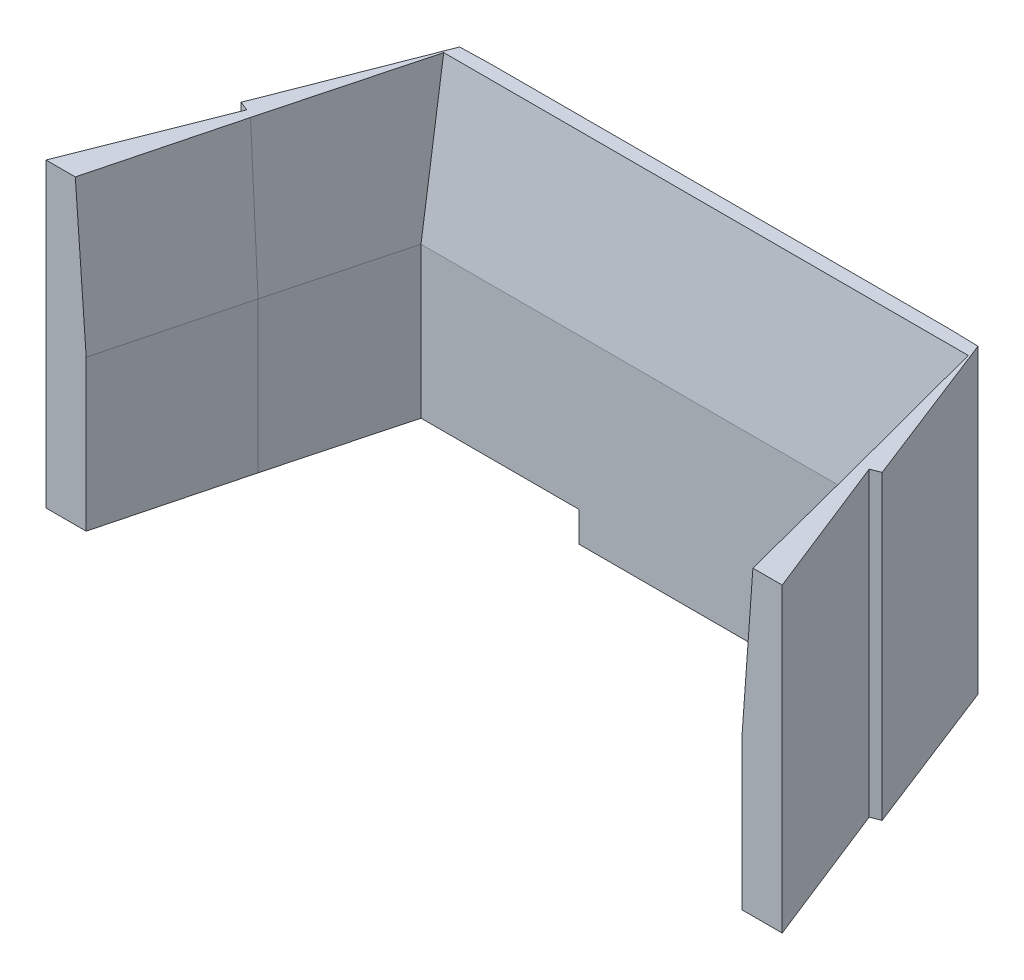
ISO-10303-21;
HEADER;
FILE_DESCRIPTION(('STEP AP214'),'2;1');
FILE_NAME('part.step','',(''),(''),'','','');
FILE_SCHEMA(('AUTOMOTIVE_DESIGN { 1 0 10303 214 1 1 1 1 }'));
ENDSEC;
DATA;
#1=APPLICATION_CONTEXT('core data for automotive mechanical design processes');
#2=APPLICATION_PROTOCOL_DEFINITION('international standard','automotive_design',2000,#1);
#3=PRODUCT_CONTEXT('',#1,'mechanical');
#4=PRODUCT('Part','Part','',(#3));
#5=PRODUCT_RELATED_PRODUCT_CATEGORY('part','',(#4));
#6=PRODUCT_DEFINITION_FORMATION('','',#4);
#7=PRODUCT_DEFINITION_CONTEXT('part definition',#1,'design');
#8=PRODUCT_DEFINITION('design','',#6,#7);
#9=PRODUCT_DEFINITION_SHAPE('','',#8);
#10=(LENGTH_UNIT() NAMED_UNIT(*) SI_UNIT(.MILLI.,.METRE.));
#11=(NAMED_UNIT(*) PLANE_ANGLE_UNIT() SI_UNIT($,.RADIAN.));
#12=(NAMED_UNIT(*) SI_UNIT($,.STERADIAN.) SOLID_ANGLE_UNIT());
#13=UNCERTAINTY_MEASURE_WITH_UNIT(LENGTH_MEASURE(1.E-05),#10,'distance_accuracy_value','');
#14=(GEOMETRIC_REPRESENTATION_CONTEXT(3) GLOBAL_UNCERTAINTY_ASSIGNED_CONTEXT((#13)) GLOBAL_UNIT_ASSIGNED_CONTEXT((#10,
#11,#12)) REPRESENTATION_CONTEXT('',''));
#15=CARTESIAN_POINT('',(0.,0.,0.));
#16=DIRECTION('',(0.,0.,1.));
#17=DIRECTION('',(1.,0.,0.));
#18=AXIS2_PLACEMENT_3D('',#15,#16,#17);
#19=CARTESIAN_POINT('',(0.,0.,0.));
#20=DIRECTION('',(0.,1.,0.));
#21=DIRECTION('',(0.,0.,1.));
#22=AXIS2_PLACEMENT_3D('',#19,#20,#21);
#23=PLANE('',#22);
#24=DIRECTION('',(1.,0.,0.));
#25=VECTOR('',#24,1.);
#26=CARTESIAN_POINT('',(0.,0.,-31.4085762737027));
#27=LINE('',#26,#25);
#28=CARTESIAN_POINT('',(1.87131752225652,0.,-31.4085762737027));
#29=VERTEX_POINT('',#28);
#30=CARTESIAN_POINT('',(17.593050571942,0.,-31.4085762737027));
#31=VERTEX_POINT('',#30);
#32=EDGE_CURVE('E219',#29,#31,#27,.T.);
#33=ORIENTED_EDGE('',*,*,#32,.F.);
#34=DIRECTION('',(0.255852608363393,0.,-0.96671580249505));
#35=VECTOR('',#34,1.);
#36=CARTESIAN_POINT('',(-6.01967544510194,0.,-1.59317729177008));
#37=LINE('',#36,#35);
#38=CARTESIAN_POINT('',(-1.52281229679167,0.,-18.5841655601201));
#39=VERTEX_POINT('',#38);
#40=EDGE_CURVE('E209',#39,#29,#37,.T.);
#41=ORIENTED_EDGE('',*,*,#40,.F.);
#42=DIRECTION('',(0.251195811000128,0.,-0.967936291568814));
#43=VECTOR('',#42,1.);
#44=CARTESIAN_POINT('',(-5.94530651938421,0.,-1.54290742664533));
#45=LINE('',#44,#43);
#46=CARTESIAN_POINT('',(-5.04813262454156,0.,-5.));
#47=VERTEX_POINT('',#46);
#48=EDGE_CURVE('E228',#47,#39,#45,.T.);
#49=ORIENTED_EDGE('',*,*,#48,.F.);
#50=DIRECTION('',(-1.,0.,0.));
#51=VECTOR('',#50,1.);
#52=CARTESIAN_POINT('',(0.,0.,-5.));
#53=LINE('',#52,#51);
#54=CARTESIAN_POINT('',(-9.04813262454156,0.,-5.));
#55=VERTEX_POINT('',#54);
#56=EDGE_CURVE('E344',#47,#55,#53,.T.);
#57=ORIENTED_EDGE('',*,*,#56,.T.);
#58=DIRECTION('',(0.367895181319904,0.,-0.929867267711685));
#59=VECTOR('',#58,1.);
#60=CARTESIAN_POINT('',(-9.5339646800782,0.,-3.77204337271335));
#61=LINE('',#60,#59);
#62=CARTESIAN_POINT('',(-3.38254683221504,0.,-19.31995592276));
#63=VERTEX_POINT('',#62);
#64=EDGE_CURVE('E275',#55,#63,#61,.T.);
#65=ORIENTED_EDGE('',*,*,#64,.T.);
#66=DIRECTION('',(-0.931536735792092,0.,-0.363647232726738));
#67=VECTOR('',#66,1.);
#68=CARTESIAN_POINT('',(6.09734401900423,0.,-15.6192579876795));
#69=LINE('',#68,#67);
#70=CARTESIAN_POINT('',(-4.31578426255812,0.,-19.6842670615286));
#71=VERTEX_POINT('',#70);
#72=EDGE_CURVE('E256',#63,#71,#69,.T.);
#73=ORIENTED_EDGE('',*,*,#72,.T.);
#74=DIRECTION('',(-0.363647232726733,0.,0.931536735792094));
#75=VECTOR('',#74,1.);
#76=CARTESIAN_POINT('',(-10.4131282815623,0.,-4.06500907384906));
#77=LINE('',#76,#75);
#78=CARTESIAN_POINT('',(1.79305057194196,0.,-35.3329604904691));
#79=VERTEX_POINT('',#78);
#80=EDGE_CURVE('E311',#79,#71,#77,.T.);
#81=ORIENTED_EDGE('',*,*,#80,.F.);
#82=DIRECTION('',(-0.999682498681667,0.,0.0251972583742492));
#83=VECTOR('',#82,1.);
#84=CARTESIAN_POINT('',(-0.888872654082395,0.,-35.2653619153664));
#85=LINE('',#84,#83);
#86=CARTESIAN_POINT('',(4.79305057194196,0.,-35.4085762737027));
#87=VERTEX_POINT('',#86);
#88=EDGE_CURVE('E331',#87,#79,#85,.T.);
#89=ORIENTED_EDGE('',*,*,#88,.F.);
#90=DIRECTION('',(-1.,0.,0.));
#91=VECTOR('',#90,1.);
#92=CARTESIAN_POINT('',(0.,0.,-35.4085762737027));
#93=LINE('',#92,#91);
#94=CARTESIAN_POINT('',(50.393050571942,0.,-35.4085762737027));
#95=VERTEX_POINT('',#94);
#96=EDGE_CURVE('E329',#95,#87,#93,.T.);
#97=ORIENTED_EDGE('',*,*,#96,.F.);
#98=DIRECTION('',(0.999682498681667,0.,0.0251972583742515));
#99=VECTOR('',#98,1.);
#100=CARTESIAN_POINT('',(0.92391041066605,0.,-36.6554588667656));
#101=LINE('',#100,#99);
#102=CARTESIAN_POINT('',(53.393050571942,0.,-35.3329604904691));
#103=VERTEX_POINT('',#102);
#104=EDGE_CURVE('E326',#95,#103,#101,.T.);
#105=ORIENTED_EDGE('',*,*,#104,.T.);
#106=DIRECTION('',(0.363647232726733,0.,0.931536735792094));
#107=VECTOR('',#106,1.);
#108=CARTESIAN_POINT('',(58.3014574957734,0.,-22.7593425655358));
#109=LINE('',#108,#107);
#110=CARTESIAN_POINT('',(59.501885406442,0.,-19.6842670615286));
#111=VERTEX_POINT('',#110);
#112=EDGE_CURVE('E323',#103,#111,#109,.T.);
#113=ORIENTED_EDGE('',*,*,#112,.T.);
#114=DIRECTION('',(-0.931536735792092,0.,0.363647232726738));
#115=VECTOR('',#114,1.);
#116=CARTESIAN_POINT('',(1.20042791066875,0.,3.07507550400744));
#117=LINE('',#116,#115);
#118=CARTESIAN_POINT('',(58.568647976099,0.,-19.31995592276));
#119=VERTEX_POINT('',#118);
#120=EDGE_CURVE('E269',#111,#119,#117,.T.);
#121=ORIENTED_EDGE('',*,*,#120,.T.);
#122=DIRECTION('',(0.367895181319904,0.,0.929867267711685));
#123=VECTOR('',#122,1.);
#124=CARTESIAN_POINT('',(57.2508000735567,0.,-22.6508601873933));
#125=LINE('',#124,#123);
#126=CARTESIAN_POINT('',(64.2342337684255,0.,-5.00000000000001));
#127=VERTEX_POINT('',#126);
#128=EDGE_CURVE('E272',#119,#127,#125,.T.);
#129=ORIENTED_EDGE('',*,*,#128,.T.);
#130=CARTESIAN_POINT('',(60.2342337684255,0.,-5.));
#131=VERTEX_POINT('',#130);
#132=EDGE_CURVE('E346',#127,#131,#53,.T.);
#133=ORIENTED_EDGE('',*,*,#132,.T.);
#134=DIRECTION('',(-0.251195811000129,0.,-0.967936291568814));
#135=VECTOR('',#134,1.);
#136=CARTESIAN_POINT('',(57.6492013542393,0.,-14.9609411423317));
#137=LINE('',#136,#135);
#138=CARTESIAN_POINT('',(56.7089134406756,0.,-18.5841655601201));
#139=VERTEX_POINT('',#138);
#140=EDGE_CURVE('E225',#131,#139,#137,.T.);
#141=ORIENTED_EDGE('',*,*,#140,.T.);
#142=DIRECTION('',(-0.255852608363393,0.,-0.96671580249505));
#143=VECTOR('',#142,1.);
#144=CARTESIAN_POINT('',(57.5932636580611,0.,-15.2427287244547));
#145=LINE('',#144,#143);
#146=CARTESIAN_POINT('',(53.3147836216274,0.,-31.4085762737027));
#147=VERTEX_POINT('',#146);
#148=EDGE_CURVE('E202',#139,#147,#145,.T.);
#149=ORIENTED_EDGE('',*,*,#148,.T.);
#150=CARTESIAN_POINT('',(37.593050571942,0.,-31.4085762737027));
#151=VERTEX_POINT('',#150);
#152=EDGE_CURVE('E212',#151,#147,#27,.T.);
#153=ORIENTED_EDGE('',*,*,#152,.F.);
#154=DIRECTION('',(0.,0.,1.));
#155=VECTOR('',#154,1.);
#156=CARTESIAN_POINT('',(37.593050571942,0.,-31.4085762737027));
#157=LINE('',#156,#155);
#158=CARTESIAN_POINT('',(37.593050571942,0.,-33.4085762737027));
#159=VERTEX_POINT('',#158);
#160=EDGE_CURVE('E283',#159,#151,#157,.T.);
#161=ORIENTED_EDGE('',*,*,#160,.F.);
#162=DIRECTION('',(1.,0.,0.));
#163=VECTOR('',#162,1.);
#164=CARTESIAN_POINT('',(17.593050571942,0.,-33.4085762737027));
#165=LINE('',#164,#163);
#166=CARTESIAN_POINT('',(17.593050571942,0.,-33.4085762737027));
#167=VERTEX_POINT('',#166);
#168=EDGE_CURVE('E292',#167,#159,#165,.T.);
#169=ORIENTED_EDGE('',*,*,#168,.F.);
#170=DIRECTION('',(0.,0.,-1.));
#171=VECTOR('',#170,1.);
#172=CARTESIAN_POINT('',(17.593050571942,0.,-31.4085762737027));
#173=LINE('',#172,#171);
#174=EDGE_CURVE('E278',#31,#167,#173,.T.);
#175=ORIENTED_EDGE('',*,*,#174,.F.);
#176=EDGE_LOOP('',(#33,#41,#49,#57,#65,#73,#81,#89,#97,#105,#113,#121,#129,#133,#141,#149,#153,
#161,#169,#175));
#177=FACE_BOUND('',#176,.T.);
#178=ADVANCED_FACE('F40',(#177),#23,.F.);
#179=CARTESIAN_POINT('',(0.,30.,0.));
#180=DIRECTION('',(0.,1.,0.));
#181=DIRECTION('',(0.,0.,1.));
#182=AXIS2_PLACEMENT_3D('',#179,#180,#181);
#183=PLANE('',#182);
#184=DIRECTION('',(1.,0.,0.));
#185=VECTOR('',#184,1.);
#186=CARTESIAN_POINT('',(54.3997996898922,30.,-34.0534809843297));
#187=LINE('',#186,#185);
#188=CARTESIAN_POINT('',(1.48630632340626,30.,-34.0534809843297));
#189=VERTEX_POINT('',#188);
#190=CARTESIAN_POINT('',(53.6997948204777,30.,-34.0534809843297));
#191=VERTEX_POINT('',#190);
#192=EDGE_CURVE('E370',#189,#191,#187,.T.);
#193=ORIENTED_EDGE('',*,*,#192,.T.);
#194=DIRECTION('',(0.255852608363393,0.,0.96671580249505));
#195=VECTOR('',#194,1.);
#196=CARTESIAN_POINT('',(58.6072539699195,30.,-15.5110930829089));
#197=LINE('',#196,#195);
#198=CARTESIAN_POINT('',(57.723549717997,30.,-18.8500891968442));
#199=VERTEX_POINT('',#198);
#200=EDGE_CURVE('E56',#191,#199,#197,.T.);
#201=ORIENTED_EDGE('',*,*,#200,.T.);
#202=DIRECTION('',(0.251195811000129,0.,0.967936291568814));
#203=VECTOR('',#202,1.);
#204=CARTESIAN_POINT('',(58.6644718397468,30.,-15.2244209758838));
#205=LINE('',#204,#203);
#206=CARTESIAN_POINT('',(61.3178817195242,30.,-5.));
#207=VERTEX_POINT('',#206);
#208=EDGE_CURVE('E352',#199,#207,#205,.T.);
#209=ORIENTED_EDGE('',*,*,#208,.T.);
#210=DIRECTION('',(1.,0.,0.));
#211=VECTOR('',#210,1.);
#212=CARTESIAN_POINT('',(-90.,30.,-5.));
#213=LINE('',#212,#211);
#214=CARTESIAN_POINT('',(64.2342337684255,30.,-5.00000000000001));
#215=VERTEX_POINT('',#214);
#216=EDGE_CURVE('E305',#207,#215,#213,.T.);
#217=ORIENTED_EDGE('',*,*,#216,.T.);
#218=DIRECTION('',(0.367895181319904,0.,0.929867267711685));
#219=VECTOR('',#218,1.);
#220=CARTESIAN_POINT('',(64.2342337684255,30.,-5.00000000000001));
#221=LINE('',#220,#219);
#222=CARTESIAN_POINT('',(58.568647976099,30.,-19.31995592276));
#223=VERTEX_POINT('',#222);
#224=EDGE_CURVE('E260',#223,#215,#221,.T.);
#225=ORIENTED_EDGE('',*,*,#224,.F.);
#226=DIRECTION('',(-0.931536735792092,0.,0.363647232726738));
#227=VECTOR('',#226,1.);
#228=CARTESIAN_POINT('',(58.568647976099,30.,-19.31995592276));
#229=LINE('',#228,#227);
#230=CARTESIAN_POINT('',(59.501885406442,30.,-19.6842670615286));
#231=VERTEX_POINT('',#230);
#232=EDGE_CURVE('E239',#231,#223,#229,.T.);
#233=ORIENTED_EDGE('',*,*,#232,.F.);
#234=DIRECTION('',(0.363647232726733,0.,0.931536735792094));
#235=VECTOR('',#234,1.);
#236=CARTESIAN_POINT('',(58.3014574957734,30.,-22.7593425655358));
#237=LINE('',#236,#235);
#238=CARTESIAN_POINT('',(53.393050571942,30.,-35.3329604904691));
#239=VERTEX_POINT('',#238);
#240=EDGE_CURVE('E307',#239,#231,#237,.T.);
#241=ORIENTED_EDGE('',*,*,#240,.F.);
#242=DIRECTION('',(0.999682498681667,0.,0.0251972583742515));
#243=VECTOR('',#242,1.);
#244=CARTESIAN_POINT('',(0.92391041066605,30.,-36.6554588667656));
#245=LINE('',#244,#243);
#246=CARTESIAN_POINT('',(50.393050571942,30.,-35.4085762737027));
#247=VERTEX_POINT('',#246);
#248=EDGE_CURVE('E310',#247,#239,#245,.T.);
#249=ORIENTED_EDGE('',*,*,#248,.F.);
#250=DIRECTION('',(-1.,0.,0.));
#251=VECTOR('',#250,1.);
#252=CARTESIAN_POINT('',(0.,30.,-35.4085762737027));
#253=LINE('',#252,#251);
#254=CARTESIAN_POINT('',(4.79305057194196,30.,-35.4085762737027));
#255=VERTEX_POINT('',#254);
#256=EDGE_CURVE('E314',#247,#255,#253,.T.);
#257=ORIENTED_EDGE('',*,*,#256,.T.);
#258=DIRECTION('',(-0.999682498681667,0.,0.0251972583742492));
#259=VECTOR('',#258,1.);
#260=CARTESIAN_POINT('',(-0.888872654082395,30.,-35.2653619153664));
#261=LINE('',#260,#259);
#262=CARTESIAN_POINT('',(1.79305057194196,30.,-35.3329604904691));
#263=VERTEX_POINT('',#262);
#264=EDGE_CURVE('E316',#255,#263,#261,.T.);
#265=ORIENTED_EDGE('',*,*,#264,.T.);
#266=DIRECTION('',(-0.363647232726733,0.,0.931536735792094));
#267=VECTOR('',#266,1.);
#268=CARTESIAN_POINT('',(-10.4131282815623,30.,-4.06500907384906));
#269=LINE('',#268,#267);
#270=CARTESIAN_POINT('',(-4.3157842625581,30.,-19.6842670615286));
#271=VERTEX_POINT('',#270);
#272=EDGE_CURVE('E318',#263,#271,#269,.T.);
#273=ORIENTED_EDGE('',*,*,#272,.T.);
#274=DIRECTION('',(-0.931536735792092,0.,-0.363647232726738));
#275=VECTOR('',#274,1.);
#276=CARTESIAN_POINT('',(-3.38254683221504,30.,-19.31995592276));
#277=LINE('',#276,#275);
#278=CARTESIAN_POINT('',(-3.38254683221504,30.,-19.31995592276));
#279=VERTEX_POINT('',#278);
#280=EDGE_CURVE('E250',#279,#271,#277,.T.);
#281=ORIENTED_EDGE('',*,*,#280,.F.);
#282=DIRECTION('',(0.367895181319904,0.,-0.929867267711685));
#283=VECTOR('',#282,1.);
#284=CARTESIAN_POINT('',(-3.529704904743,30.,-18.9480090156753));
#285=LINE('',#284,#283);
#286=CARTESIAN_POINT('',(-9.04813262454156,30.,-5.));
#287=VERTEX_POINT('',#286);
#288=EDGE_CURVE('E247',#287,#279,#285,.T.);
#289=ORIENTED_EDGE('',*,*,#288,.F.);
#290=CARTESIAN_POINT('',(-6.13178057564033,30.,-5.));
#291=VERTEX_POINT('',#290);
#292=EDGE_CURVE('E220',#287,#291,#213,.T.);
#293=ORIENTED_EDGE('',*,*,#292,.T.);
#294=DIRECTION('',(0.251195811000128,0.,-0.967936291568814));
#295=VECTOR('',#294,1.);
#296=CARTESIAN_POINT('',(-2.53808278229914,30.,-18.8476453936722));
#297=LINE('',#296,#295);
#298=CARTESIAN_POINT('',(-2.53744857411366,30.,-18.8500891968419));
#299=VERTEX_POINT('',#298);
#300=EDGE_CURVE('E363',#291,#299,#297,.T.);
#301=ORIENTED_EDGE('',*,*,#300,.T.);
#302=DIRECTION('',(0.255852608363393,0.,-0.96671580249505));
#303=VECTOR('',#302,1.);
#304=CARTESIAN_POINT('',(0.857327210398154,30.,-31.676940632157));
#305=LINE('',#304,#303);
#306=EDGE_CURVE('E64',#299,#189,#305,.T.);
#307=ORIENTED_EDGE('',*,*,#306,.T.);
#308=EDGE_LOOP('',(#193,#201,#209,#217,#225,#233,#241,#249,#257,#265,#273,#281,#289,#293,#301,#307));
#309=FACE_BOUND('',#308,.T.);
#310=ADVANCED_FACE('F379',(#309),#183,.T.);
#311=CARTESIAN_POINT('',(-90.,0.,-5.));
#312=DIRECTION('',(0.,0.,-1.));
#313=DIRECTION('',(-1.,0.,0.));
#314=AXIS2_PLACEMENT_3D('',#311,#312,#313);
#315=PLANE('',#314);
#316=ORIENTED_EDGE('',*,*,#216,.F.);
#317=DIRECTION('',(0.0720554099838902,0.99740063058535,0.));
#318=VECTOR('',#317,1.);
#319=CARTESIAN_POINT('',(61.3041052629034,29.8093044432896,-5.));
#320=LINE('',#319,#318);
#321=CARTESIAN_POINT('',(60.2342337684255,14.9999999999992,-5.));
#322=VERTEX_POINT('',#321);
#323=EDGE_CURVE('E356',#207,#322,#320,.F.);
#324=ORIENTED_EDGE('',*,*,#323,.T.);
#325=DIRECTION('',(0.,-1.,0.));
#326=VECTOR('',#325,1.);
#327=CARTESIAN_POINT('',(60.2342337684255,40.,-5.));
#328=LINE('',#327,#326);
#329=EDGE_CURVE('E244',#322,#131,#328,.T.);
#330=ORIENTED_EDGE('',*,*,#329,.T.);
#331=ORIENTED_EDGE('',*,*,#132,.F.);
#332=DIRECTION('',(0.,1.,0.));
#333=VECTOR('',#332,1.);
#334=CARTESIAN_POINT('',(64.2342337684255,-10.,-5.00000000000001));
#335=LINE('',#334,#333);
#336=EDGE_CURVE('E251',#127,#215,#335,.T.);
#337=ORIENTED_EDGE('',*,*,#336,.T.);
#338=EDGE_LOOP('',(#316,#324,#330,#331,#337));
#339=FACE_BOUND('',#338,.T.);
#340=ADVANCED_FACE('F386',(#339),#315,.F.);
#341=DIRECTION('',(0.,-1.,0.));
#342=VECTOR('',#341,1.);
#343=CARTESIAN_POINT('',(-5.04813262454156,40.,-5.));
#344=LINE('',#343,#342);
#345=CARTESIAN_POINT('',(-5.04813262454156,14.9999999999993,-5.));
#346=VERTEX_POINT('',#345);
#347=EDGE_CURVE('E242',#346,#47,#344,.T.);
#348=ORIENTED_EDGE('',*,*,#347,.F.);
#349=DIRECTION('',(-0.0720554099838902,0.99740063058535,0.));
#350=VECTOR('',#349,1.);
#351=CARTESIAN_POINT('',(-5.0527907353513,15.0644781933786,-5.));
#352=LINE('',#351,#350);
#353=EDGE_CURVE('E368',#346,#291,#352,.T.);
#354=ORIENTED_EDGE('',*,*,#353,.T.);
#355=ORIENTED_EDGE('',*,*,#292,.F.);
#356=DIRECTION('',(0.,1.,0.));
#357=VECTOR('',#356,1.);
#358=CARTESIAN_POINT('',(-9.04813262454156,-10.,-5.));
#359=LINE('',#358,#357);
#360=EDGE_CURVE('E253',#55,#287,#359,.T.);
#361=ORIENTED_EDGE('',*,*,#360,.F.);
#362=ORIENTED_EDGE('',*,*,#56,.F.);
#363=EDGE_LOOP('',(#348,#354,#355,#361,#362));
#364=FACE_BOUND('',#363,.T.);
#365=ADVANCED_FACE('F436',(#364),#315,.F.);
#366=CARTESIAN_POINT('',(0.,30.,-31.4085762737027));
#367=DIRECTION('',(0.,0.,-1.));
#368=DIRECTION('',(-1.,0.,0.));
#369=AXIS2_PLACEMENT_3D('',#366,#367,#368);
#370=PLANE('',#369);
#371=DIRECTION('',(0.,-1.,0.));
#372=VECTOR('',#371,1.);
#373=CARTESIAN_POINT('',(53.3147836216274,40.,-31.4085762737027));
#374=LINE('',#373,#372);
#375=CARTESIAN_POINT('',(53.3147836216274,14.9999999999992,-31.4085762737027));
#376=VERTEX_POINT('',#375);
#377=EDGE_CURVE('E197',#376,#147,#374,.T.);
#378=ORIENTED_EDGE('',*,*,#377,.F.);
#379=DIRECTION('',(-1.,0.,0.));
#380=VECTOR('',#379,1.);
#381=CARTESIAN_POINT('',(0.786301453991694,14.9999999999996,-31.4085762737027));
#382=LINE('',#381,#380);
#383=CARTESIAN_POINT('',(1.87131752225652,14.9999999999993,-31.4085762737027));
#384=VERTEX_POINT('',#383);
#385=EDGE_CURVE('E373',#376,#384,#382,.T.);
#386=ORIENTED_EDGE('',*,*,#385,.T.);
#387=DIRECTION('',(0.,-1.,0.));
#388=VECTOR('',#387,1.);
#389=CARTESIAN_POINT('',(1.87131752225652,40.,-31.4085762737027));
#390=LINE('',#389,#388);
#391=EDGE_CURVE('E237',#384,#29,#390,.T.);
#392=ORIENTED_EDGE('',*,*,#391,.T.);
#393=ORIENTED_EDGE('',*,*,#32,.T.);
#394=DIRECTION('',(0.,1.,0.));
#395=VECTOR('',#394,1.);
#396=CARTESIAN_POINT('',(17.593050571942,-3.,-31.4085762737027));
#397=LINE('',#396,#395);
#398=CARTESIAN_POINT('',(17.593050571942,-3.,-31.4085762737027));
#399=VERTEX_POINT('',#398);
#400=EDGE_CURVE('E289',#399,#31,#397,.T.);
#401=ORIENTED_EDGE('',*,*,#400,.F.);
#402=DIRECTION('',(-1.,0.,0.));
#403=VECTOR('',#402,1.);
#404=CARTESIAN_POINT('',(17.593050571942,-3.,-31.4085762737027));
#405=LINE('',#404,#403);
#406=CARTESIAN_POINT('',(37.593050571942,-3.,-31.4085762737027));
#407=VERTEX_POINT('',#406);
#408=EDGE_CURVE('E287',#407,#399,#405,.T.);
#409=ORIENTED_EDGE('',*,*,#408,.F.);
#410=DIRECTION('',(0.,1.,0.));
#411=VECTOR('',#410,1.);
#412=CARTESIAN_POINT('',(37.593050571942,-3.,-31.4085762737027));
#413=LINE('',#412,#411);
#414=EDGE_CURVE('E216',#407,#151,#413,.T.);
#415=ORIENTED_EDGE('',*,*,#414,.T.);
#416=ORIENTED_EDGE('',*,*,#152,.T.);
#417=EDGE_LOOP('',(#378,#386,#392,#393,#401,#409,#415,#416));
#418=FACE_BOUND('',#417,.T.);
#419=ADVANCED_FACE('F213',(#418),#370,.F.);
#420=CARTESIAN_POINT('',(58.3014574957734,30.,-22.7593425655358));
#421=DIRECTION('',(0.931536735792094,0.,-0.363647232726733));
#422=DIRECTION('',(-0.363647232726733,0.,-0.931536735792094));
#423=AXIS2_PLACEMENT_3D('',#420,#421,#422);
#424=PLANE('',#423);
#425=DIRECTION('',(0.,1.,0.));
#426=VECTOR('',#425,1.);
#427=CARTESIAN_POINT('',(59.501885406442,30.,-19.6842670615286));
#428=LINE('',#427,#426);
#429=EDGE_CURVE('E350',#111,#231,#428,.T.);
#430=ORIENTED_EDGE('',*,*,#429,.F.);
#431=ORIENTED_EDGE('',*,*,#112,.F.);
#432=DIRECTION('',(0.,-1.,0.));
#433=VECTOR('',#432,1.);
#434=CARTESIAN_POINT('',(53.393050571942,30.,-35.3329604904691));
#435=LINE('',#434,#433);
#436=EDGE_CURVE('E342',#239,#103,#435,.T.);
#437=ORIENTED_EDGE('',*,*,#436,.F.);
#438=ORIENTED_EDGE('',*,*,#240,.T.);
#439=EDGE_LOOP('',(#430,#431,#437,#438));
#440=FACE_BOUND('',#439,.T.);
#441=ADVANCED_FACE('F403',(#440),#424,.T.);
#442=CARTESIAN_POINT('',(0.92391041066605,30.,-36.6554588667656));
#443=DIRECTION('',(0.0251972583742515,0.,-0.999682498681667));
#444=DIRECTION('',(-0.999682498681667,0.,-0.0251972583742515));
#445=AXIS2_PLACEMENT_3D('',#442,#443,#444);
#446=PLANE('',#445);
#447=ORIENTED_EDGE('',*,*,#104,.F.);
#448=DIRECTION('',(0.,-1.,0.));
#449=VECTOR('',#448,1.);
#450=CARTESIAN_POINT('',(50.393050571942,30.,-35.4085762737027));
#451=LINE('',#450,#449);
#452=EDGE_CURVE('E340',#247,#95,#451,.T.);
#453=ORIENTED_EDGE('',*,*,#452,.F.);
#454=ORIENTED_EDGE('',*,*,#248,.T.);
#455=ORIENTED_EDGE('',*,*,#436,.T.);
#456=EDGE_LOOP('',(#447,#453,#454,#455));
#457=FACE_BOUND('',#456,.T.);
#458=ADVANCED_FACE('F407',(#457),#446,.T.);
#459=CARTESIAN_POINT('',(0.,30.,-35.4085762737027));
#460=DIRECTION('',(0.,0.,1.));
#461=DIRECTION('',(1.,0.,0.));
#462=AXIS2_PLACEMENT_3D('',#459,#460,#461);
#463=PLANE('',#462);
#464=ORIENTED_EDGE('',*,*,#96,.T.);
#465=DIRECTION('',(0.,-1.,0.));
#466=VECTOR('',#465,1.);
#467=CARTESIAN_POINT('',(4.79305057194196,30.,-35.4085762737027));
#468=LINE('',#467,#466);
#469=EDGE_CURVE('E337',#255,#87,#468,.T.);
#470=ORIENTED_EDGE('',*,*,#469,.F.);
#471=ORIENTED_EDGE('',*,*,#256,.F.);
#472=ORIENTED_EDGE('',*,*,#452,.T.);
#473=EDGE_LOOP('',(#464,#470,#471,#472));
#474=FACE_BOUND('',#473,.T.);
#475=ADVANCED_FACE('F413',(#474),#463,.F.);
#476=CARTESIAN_POINT('',(-0.888872654082395,30.,-35.2653619153664));
#477=DIRECTION('',(0.0251972583742492,0.,0.999682498681667));
#478=DIRECTION('',(0.999682498681667,0.,-0.0251972583742492));
#479=AXIS2_PLACEMENT_3D('',#476,#477,#478);
#480=PLANE('',#479);
#481=ORIENTED_EDGE('',*,*,#88,.T.);
#482=DIRECTION('',(0.,-1.,0.));
#483=VECTOR('',#482,1.);
#484=CARTESIAN_POINT('',(1.79305057194196,30.,-35.3329604904691));
#485=LINE('',#484,#483);
#486=EDGE_CURVE('E320',#263,#79,#485,.T.);
#487=ORIENTED_EDGE('',*,*,#486,.F.);
#488=ORIENTED_EDGE('',*,*,#264,.F.);
#489=ORIENTED_EDGE('',*,*,#469,.T.);
#490=EDGE_LOOP('',(#481,#487,#488,#489));
#491=FACE_BOUND('',#490,.T.);
#492=ADVANCED_FACE('F417',(#491),#480,.F.);
#493=CARTESIAN_POINT('',(-10.4131282815623,30.,-4.06500907384906));
#494=DIRECTION('',(0.931536735792094,0.,0.363647232726733));
#495=DIRECTION('',(0.363647232726733,0.,-0.931536735792094));
#496=AXIS2_PLACEMENT_3D('',#493,#494,#495);
#497=PLANE('',#496);
#498=ORIENTED_EDGE('',*,*,#80,.T.);
#499=DIRECTION('',(0.,1.,0.));
#500=VECTOR('',#499,1.);
#501=CARTESIAN_POINT('',(-4.31578426255811,30.,-19.6842670615286));
#502=LINE('',#501,#500);
#503=EDGE_CURVE('E347',#71,#271,#502,.T.);
#504=ORIENTED_EDGE('',*,*,#503,.T.);
#505=ORIENTED_EDGE('',*,*,#272,.F.);
#506=ORIENTED_EDGE('',*,*,#486,.T.);
#507=EDGE_LOOP('',(#498,#504,#505,#506));
#508=FACE_BOUND('',#507,.T.);
#509=ADVANCED_FACE('F421',(#508),#497,.F.);
#510=CARTESIAN_POINT('',(17.593050571942,-3.,-31.4085762737027));
#511=DIRECTION('',(1.,0.,0.));
#512=DIRECTION('',(0.,0.,-1.));
#513=AXIS2_PLACEMENT_3D('',#510,#511,#512);
#514=PLANE('',#513);
#515=ORIENTED_EDGE('',*,*,#174,.T.);
#516=DIRECTION('',(0.,1.,0.));
#517=VECTOR('',#516,1.);
#518=CARTESIAN_POINT('',(17.593050571942,-3.,-33.4085762737027));
#519=LINE('',#518,#517);
#520=CARTESIAN_POINT('',(17.593050571942,-3.,-33.4085762737027));
#521=VERTEX_POINT('',#520);
#522=EDGE_CURVE('E302',#521,#167,#519,.T.);
#523=ORIENTED_EDGE('',*,*,#522,.F.);
#524=DIRECTION('',(0.,0.,-1.));
#525=VECTOR('',#524,1.);
#526=CARTESIAN_POINT('',(17.593050571942,-3.,-31.4085762737027));
#527=LINE('',#526,#525);
#528=EDGE_CURVE('E279',#399,#521,#527,.T.);
#529=ORIENTED_EDGE('',*,*,#528,.F.);
#530=ORIENTED_EDGE('',*,*,#400,.T.);
#531=EDGE_LOOP('',(#515,#523,#529,#530));
#532=FACE_BOUND('',#531,.T.);
#533=ADVANCED_FACE('F457',(#532),#514,.F.);
#534=CARTESIAN_POINT('',(17.593050571942,-3.,-33.4085762737027));
#535=DIRECTION('',(0.,0.,1.));
#536=DIRECTION('',(1.,0.,0.));
#537=AXIS2_PLACEMENT_3D('',#534,#535,#536);
#538=PLANE('',#537);
#539=ORIENTED_EDGE('',*,*,#168,.T.);
#540=DIRECTION('',(0.,1.,0.));
#541=VECTOR('',#540,1.);
#542=CARTESIAN_POINT('',(37.593050571942,-3.,-33.4085762737027));
#543=LINE('',#542,#541);
#544=CARTESIAN_POINT('',(37.593050571942,-3.,-33.4085762737027));
#545=VERTEX_POINT('',#544);
#546=EDGE_CURVE('E299',#545,#159,#543,.T.);
#547=ORIENTED_EDGE('',*,*,#546,.F.);
#548=DIRECTION('',(1.,0.,0.));
#549=VECTOR('',#548,1.);
#550=CARTESIAN_POINT('',(17.593050571942,-3.,-33.4085762737027));
#551=LINE('',#550,#549);
#552=EDGE_CURVE('E282',#521,#545,#551,.T.);
#553=ORIENTED_EDGE('',*,*,#552,.F.);
#554=ORIENTED_EDGE('',*,*,#522,.T.);
#555=EDGE_LOOP('',(#539,#547,#553,#554));
#556=FACE_BOUND('',#555,.T.);
#557=ADVANCED_FACE('F466',(#556),#538,.F.);
#558=CARTESIAN_POINT('',(37.593050571942,-3.,-31.4085762737027));
#559=DIRECTION('',(-1.,0.,0.));
#560=DIRECTION('',(0.,0.,1.));
#561=AXIS2_PLACEMENT_3D('',#558,#559,#560);
#562=PLANE('',#561);
#563=ORIENTED_EDGE('',*,*,#160,.T.);
#564=ORIENTED_EDGE('',*,*,#414,.F.);
#565=DIRECTION('',(0.,0.,1.));
#566=VECTOR('',#565,1.);
#567=CARTESIAN_POINT('',(37.593050571942,-3.,-31.4085762737027));
#568=LINE('',#567,#566);
#569=EDGE_CURVE('E285',#545,#407,#568,.T.);
#570=ORIENTED_EDGE('',*,*,#569,.F.);
#571=ORIENTED_EDGE('',*,*,#546,.T.);
#572=EDGE_LOOP('',(#563,#564,#570,#571));
#573=FACE_BOUND('',#572,.T.);
#574=ADVANCED_FACE('F464',(#573),#562,.F.);
#575=CARTESIAN_POINT('',(0.,-3.,0.));
#576=DIRECTION('',(0.,-1.,0.));
#577=DIRECTION('',(0.,0.,-1.));
#578=AXIS2_PLACEMENT_3D('',#575,#576,#577);
#579=PLANE('',#578);
#580=ORIENTED_EDGE('',*,*,#528,.T.);
#581=ORIENTED_EDGE('',*,*,#552,.T.);
#582=ORIENTED_EDGE('',*,*,#569,.T.);
#583=ORIENTED_EDGE('',*,*,#408,.T.);
#584=EDGE_LOOP('',(#580,#581,#582,#583));
#585=FACE_BOUND('',#584,.T.);
#586=ADVANCED_FACE('F460',(#585),#579,.T.);
#587=CARTESIAN_POINT('',(-3.529704904743,-10.,-18.9480090156753));
#588=DIRECTION('',(0.929867267711685,0.,0.367895181319904));
#589=DIRECTION('',(0.367895181319904,0.,-0.929867267711685));
#590=AXIS2_PLACEMENT_3D('',#587,#588,#589);
#591=PLANE('',#590);
#592=ORIENTED_EDGE('',*,*,#360,.T.);
#593=ORIENTED_EDGE('',*,*,#288,.T.);
#594=DIRECTION('',(0.,1.,0.));
#595=VECTOR('',#594,1.);
#596=CARTESIAN_POINT('',(-3.38254683221504,-10.,-19.31995592276));
#597=LINE('',#596,#595);
#598=EDGE_CURVE('E254',#63,#279,#597,.T.);
#599=ORIENTED_EDGE('',*,*,#598,.F.);
#600=ORIENTED_EDGE('',*,*,#64,.F.);
#601=EDGE_LOOP('',(#592,#593,#599,#600));
#602=FACE_BOUND('',#601,.T.);
#603=ADVANCED_FACE('F431',(#602),#591,.F.);
#604=CARTESIAN_POINT('',(-3.38254683221504,-10.,-19.31995592276));
#605=DIRECTION('',(0.363647232726738,0.,-0.931536735792092));
#606=DIRECTION('',(-0.931536735792092,0.,-0.363647232726738));
#607=AXIS2_PLACEMENT_3D('',#604,#605,#606);
#608=PLANE('',#607);
#609=ORIENTED_EDGE('',*,*,#598,.T.);
#610=ORIENTED_EDGE('',*,*,#280,.T.);
#611=ORIENTED_EDGE('',*,*,#503,.F.);
#612=ORIENTED_EDGE('',*,*,#72,.F.);
#613=EDGE_LOOP('',(#609,#610,#611,#612));
#614=FACE_BOUND('',#613,.T.);
#615=ADVANCED_FACE('F427',(#614),#608,.F.);
#616=CARTESIAN_POINT('',(64.2342337684255,-10.,-5.00000000000001));
#617=DIRECTION('',(-0.929867267711685,0.,0.367895181319904));
#618=DIRECTION('',(0.367895181319904,0.,0.929867267711685));
#619=AXIS2_PLACEMENT_3D('',#616,#617,#618);
#620=PLANE('',#619);
#621=DIRECTION('',(0.,1.,0.));
#622=VECTOR('',#621,1.);
#623=CARTESIAN_POINT('',(58.568647976099,-10.,-19.31995592276));
#624=LINE('',#623,#622);
#625=EDGE_CURVE('E263',#119,#223,#624,.T.);
#626=ORIENTED_EDGE('',*,*,#625,.T.);
#627=ORIENTED_EDGE('',*,*,#224,.T.);
#628=ORIENTED_EDGE('',*,*,#336,.F.);
#629=ORIENTED_EDGE('',*,*,#128,.F.);
#630=EDGE_LOOP('',(#626,#627,#628,#629));
#631=FACE_BOUND('',#630,.T.);
#632=ADVANCED_FACE('F395',(#631),#620,.F.);
#633=CARTESIAN_POINT('',(58.568647976099,-10.,-19.31995592276));
#634=DIRECTION('',(-0.363647232726738,0.,-0.931536735792092));
#635=DIRECTION('',(-0.931536735792092,0.,0.363647232726738));
#636=AXIS2_PLACEMENT_3D('',#633,#634,#635);
#637=PLANE('',#636);
#638=ORIENTED_EDGE('',*,*,#429,.T.);
#639=ORIENTED_EDGE('',*,*,#232,.T.);
#640=ORIENTED_EDGE('',*,*,#625,.F.);
#641=ORIENTED_EDGE('',*,*,#120,.F.);
#642=EDGE_LOOP('',(#638,#639,#640,#641));
#643=FACE_BOUND('',#642,.T.);
#644=ADVANCED_FACE('F397',(#643),#637,.F.);
#645=CARTESIAN_POINT('',(-5.94530651938421,40.,-1.54290742664533));
#646=DIRECTION('',(-0.967936291568814,0.,-0.251195811000128));
#647=DIRECTION('',(-0.251195811000128,0.,0.967936291568814));
#648=AXIS2_PLACEMENT_3D('',#645,#646,#647);
#649=PLANE('',#648);
#650=DIRECTION('',(0.,-1.,0.));
#651=VECTOR('',#650,1.);
#652=CARTESIAN_POINT('',(-1.52281229679167,40.,-18.5841655601201));
#653=LINE('',#652,#651);
#654=CARTESIAN_POINT('',(-1.52281229679167,14.9999999999993,-18.5841655601201));
#655=VERTEX_POINT('',#654);
#656=EDGE_CURVE('E240',#655,#39,#653,.T.);
#657=ORIENTED_EDGE('',*,*,#656,.F.);
#658=DIRECTION('',(-0.251195811000128,0.,0.967936291568814));
#659=VECTOR('',#658,1.);
#660=CARTESIAN_POINT('',(-5.04813262454156,14.9999999999992,-5.));
#661=LINE('',#660,#659);
#662=EDGE_CURVE('E366',#655,#346,#661,.T.);
#663=ORIENTED_EDGE('',*,*,#662,.T.);
#664=ORIENTED_EDGE('',*,*,#347,.T.);
#665=ORIENTED_EDGE('',*,*,#48,.T.);
#666=EDGE_LOOP('',(#657,#663,#664,#665));
#667=FACE_BOUND('',#666,.T.);
#668=ADVANCED_FACE('F451',(#667),#649,.F.);
#669=CARTESIAN_POINT('',(-6.01967544510194,40.,-1.59317729177008));
#670=DIRECTION('',(-0.96671580249505,0.,-0.255852608363393));
#671=DIRECTION('',(-0.255852608363393,0.,0.96671580249505));
#672=AXIS2_PLACEMENT_3D('',#669,#670,#671);
#673=PLANE('',#672);
#674=ORIENTED_EDGE('',*,*,#391,.F.);
#675=DIRECTION('',(-0.255852608363393,0.,0.96671580249505));
#676=VECTOR('',#675,1.);
#677=CARTESIAN_POINT('',(-1.52281229679167,14.9999999999993,-18.5841655601201));
#678=LINE('',#677,#676);
#679=EDGE_CURVE('E359',#384,#655,#678,.T.);
#680=ORIENTED_EDGE('',*,*,#679,.T.);
#681=ORIENTED_EDGE('',*,*,#656,.T.);
#682=ORIENTED_EDGE('',*,*,#40,.T.);
#683=EDGE_LOOP('',(#674,#680,#681,#682));
#684=FACE_BOUND('',#683,.T.);
#685=ADVANCED_FACE('F449',(#684),#673,.F.);
#686=CARTESIAN_POINT('',(57.6492013542393,40.,-14.9609411423317));
#687=DIRECTION('',(-0.967936291568814,0.,0.251195811000129));
#688=DIRECTION('',(0.251195811000129,0.,0.967936291568814));
#689=AXIS2_PLACEMENT_3D('',#686,#687,#688);
#690=PLANE('',#689);
#691=ORIENTED_EDGE('',*,*,#329,.F.);
#692=DIRECTION('',(-0.251195811000129,0.,-0.967936291568814));
#693=VECTOR('',#692,1.);
#694=CARTESIAN_POINT('',(57.6492013542393,14.9999999999992,-14.9609411423317));
#695=LINE('',#694,#693);
#696=CARTESIAN_POINT('',(56.7089134406756,14.9999999999992,-18.5841655601201));
#697=VERTEX_POINT('',#696);
#698=EDGE_CURVE('E358',#322,#697,#695,.T.);
#699=ORIENTED_EDGE('',*,*,#698,.T.);
#700=DIRECTION('',(0.,-1.,0.));
#701=VECTOR('',#700,1.);
#702=CARTESIAN_POINT('',(56.7089134406756,40.,-18.5841655601201));
#703=LINE('',#702,#701);
#704=EDGE_CURVE('E208',#697,#139,#703,.T.);
#705=ORIENTED_EDGE('',*,*,#704,.T.);
#706=ORIENTED_EDGE('',*,*,#140,.F.);
#707=EDGE_LOOP('',(#691,#699,#705,#706));
#708=FACE_BOUND('',#707,.T.);
#709=ADVANCED_FACE('F392',(#708),#690,.T.);
#710=CARTESIAN_POINT('',(57.5932636580611,40.,-15.2427287244547));
#711=DIRECTION('',(-0.96671580249505,0.,0.255852608363393));
#712=DIRECTION('',(0.255852608363393,0.,0.96671580249505));
#713=AXIS2_PLACEMENT_3D('',#710,#711,#712);
#714=PLANE('',#713);
#715=ORIENTED_EDGE('',*,*,#704,.F.);
#716=DIRECTION('',(-0.255852608363393,0.,-0.96671580249505));
#717=VECTOR('',#716,1.);
#718=CARTESIAN_POINT('',(57.5932636580611,14.9999999999992,-15.2427287244547));
#719=LINE('',#718,#717);
#720=EDGE_CURVE('E205',#697,#376,#719,.T.);
#721=ORIENTED_EDGE('',*,*,#720,.T.);
#722=ORIENTED_EDGE('',*,*,#377,.T.);
#723=ORIENTED_EDGE('',*,*,#148,.F.);
#724=EDGE_LOOP('',(#715,#721,#722,#723));
#725=FACE_BOUND('',#724,.T.);
#726=ADVANCED_FACE('F200',(#725),#714,.T.);
#727=CARTESIAN_POINT('',(58.6644718397468,30.,-15.2244209758838));
#728=DIRECTION('',(0.96557844741086,-0.069756473744122,-0.25058391062959));
#729=DIRECTION('',(0.251195811000129,0.,0.967936291568814));
#730=AXIS2_PLACEMENT_3D('',#727,#728,#729);
#731=PLANE('',#730);
#732=ORIENTED_EDGE('',*,*,#323,.F.);
#733=ORIENTED_EDGE('',*,*,#208,.F.);
#734=DIRECTION('',(-0.0674776440051622,-0.997564036197771,0.0176850570913694));
#735=VECTOR('',#734,1.);
#736=CARTESIAN_POINT('',(57.7235888512527,30.0005785312916,-18.8500994531872));
#737=LINE('',#736,#735);
#738=EDGE_CURVE('E226',#697,#199,#737,.F.);
#739=ORIENTED_EDGE('',*,*,#738,.F.);
#740=ORIENTED_EDGE('',*,*,#698,.F.);
#741=EDGE_LOOP('',(#732,#733,#739,#740));
#742=FACE_BOUND('',#741,.T.);
#743=ADVANCED_FACE('F390',(#742),#731,.F.);
#744=CARTESIAN_POINT('',(58.6072539699195,30.,-15.5110930829089));
#745=DIRECTION('',(0.964360931387138,-0.0697564737441226,-0.255229364268527));
#746=DIRECTION('',(0.255852608363393,0.,0.96671580249505));
#747=AXIS2_PLACEMENT_3D('',#744,#745,#746);
#748=PLANE('',#747);
#749=ORIENTED_EDGE('',*,*,#200,.F.);
#750=DIRECTION('',(0.0252693959191922,0.984493282065075,-0.173592727954299));
#751=VECTOR('',#750,1.);
#752=CARTESIAN_POINT('',(53.665505226218,28.6640806412097,-33.8179223573243));
#753=LINE('',#752,#751);
#754=EDGE_CURVE('E49',#191,#376,#753,.F.);
#755=ORIENTED_EDGE('',*,*,#754,.T.);
#756=ORIENTED_EDGE('',*,*,#720,.F.);
#757=ORIENTED_EDGE('',*,*,#738,.T.);
#758=EDGE_LOOP('',(#749,#755,#756,#757));
#759=FACE_BOUND('',#758,.T.);
#760=ADVANCED_FACE('F374',(#759),#748,.F.);
#761=CARTESIAN_POINT('',(-5.94530651938421,14.9999999999993,-1.54290742664533));
#762=DIRECTION('',(0.96557844741086,0.069756473744122,0.250583910629589));
#763=DIRECTION('',(0.251195811000128,0.,-0.967936291568814));
#764=AXIS2_PLACEMENT_3D('',#761,#762,#763);
#765=PLANE('',#764);
#766=ORIENTED_EDGE('',*,*,#353,.F.);
#767=ORIENTED_EDGE('',*,*,#662,.F.);
#768=DIRECTION('',(-0.0674776440051918,0.997564036197771,-0.0176850570912553));
#769=VECTOR('',#768,1.);
#770=CARTESIAN_POINT('',(-1.52301143230037,15.002943944245,-18.5842177510774));
#771=LINE('',#770,#769);
#772=EDGE_CURVE('E230',#299,#655,#771,.F.);
#773=ORIENTED_EDGE('',*,*,#772,.F.);
#774=ORIENTED_EDGE('',*,*,#300,.F.);
#775=EDGE_LOOP('',(#766,#767,#773,#774));
#776=FACE_BOUND('',#775,.T.);
#777=ADVANCED_FACE('F441',(#776),#765,.T.);
#778=CARTESIAN_POINT('',(-6.01967544510194,14.9999999999993,-1.59317729177008));
#779=DIRECTION('',(0.964360931387138,0.0697564737441221,0.255229364268527));
#780=DIRECTION('',(0.255852608363393,0.,-0.96671580249505));
#781=AXIS2_PLACEMENT_3D('',#778,#779,#780);
#782=PLANE('',#781);
#783=ORIENTED_EDGE('',*,*,#679,.F.);
#784=DIRECTION('',(-0.0252693959191916,0.984493282065075,-0.173592727954299));
#785=VECTOR('',#784,1.);
#786=CARTESIAN_POINT('',(1.48535725384378,30.0369756606551,-34.0600007909327));
#787=LINE('',#786,#785);
#788=EDGE_CURVE('E12',#384,#189,#787,.T.);
#789=ORIENTED_EDGE('',*,*,#788,.T.);
#790=ORIENTED_EDGE('',*,*,#306,.F.);
#791=ORIENTED_EDGE('',*,*,#772,.T.);
#792=EDGE_LOOP('',(#783,#789,#790,#791));
#793=FACE_BOUND('',#792,.T.);
#794=ADVANCED_FACE('F445',(#793),#782,.T.);
#795=CARTESIAN_POINT('',(0.,30.,-34.0534809843297));
#796=DIRECTION('',(0.,0.173648177666927,0.984807753012209));
#797=DIRECTION('',(-1.,0.,0.));
#798=AXIS2_PLACEMENT_3D('',#795,#796,#797);
#799=PLANE('',#798);
#800=ORIENTED_EDGE('',*,*,#788,.F.);
#801=ORIENTED_EDGE('',*,*,#385,.F.);
#802=ORIENTED_EDGE('',*,*,#754,.F.);
#803=ORIENTED_EDGE('',*,*,#192,.F.);
#804=EDGE_LOOP('',(#800,#801,#802,#803));
#805=FACE_BOUND('',#804,.T.);
#806=ADVANCED_FACE('F43',(#805),#799,.T.);
#807=CLOSED_SHELL('',(#178,#310,#340,#365,#419,#441,#458,#475,#492,#509,#533,#557,#574,#586,
#603,#615,#632,#644,#668,#685,#709,#726,#743,#760,#777,#794,#806));
#808=MANIFOLD_SOLID_BREP('B2',#807);
#809=ADVANCED_BREP_SHAPE_REPRESENTATION('',(#18,#808),#14);
#810=SHAPE_DEFINITION_REPRESENTATION(#9,#809);
ENDSEC;
END-ISO-10303-21;
